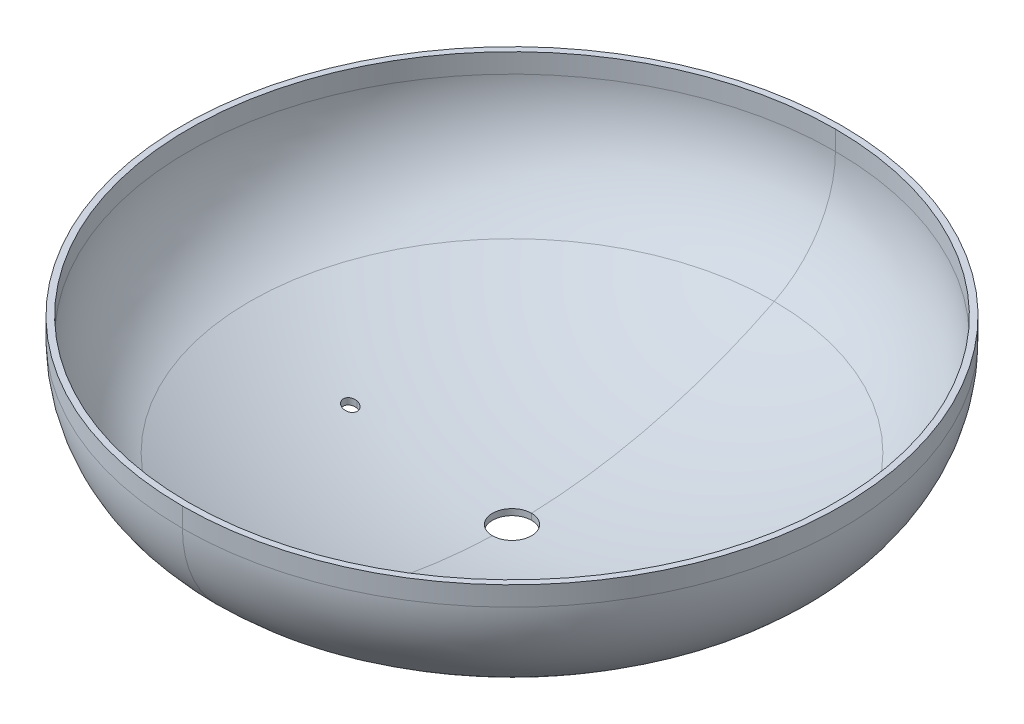
ISO-10303-21;
HEADER;
FILE_DESCRIPTION(('STEP AP214'),'2;1');
FILE_NAME('part.step','',(''),(''),'','','');
FILE_SCHEMA(('AUTOMOTIVE_DESIGN { 1 0 10303 214 1 1 1 1 }'));
ENDSEC;
DATA;
#1=APPLICATION_CONTEXT('core data for automotive mechanical design processes');
#2=APPLICATION_PROTOCOL_DEFINITION('international standard','automotive_design',2000,#1);
#3=PRODUCT_CONTEXT('',#1,'mechanical');
#4=PRODUCT('Part','Part','',(#3));
#5=PRODUCT_RELATED_PRODUCT_CATEGORY('part','',(#4));
#6=PRODUCT_DEFINITION_FORMATION('','',#4);
#7=PRODUCT_DEFINITION_CONTEXT('part definition',#1,'design');
#8=PRODUCT_DEFINITION('design','',#6,#7);
#9=PRODUCT_DEFINITION_SHAPE('','',#8);
#10=(LENGTH_UNIT() NAMED_UNIT(*) SI_UNIT(.MILLI.,.METRE.));
#11=(NAMED_UNIT(*) PLANE_ANGLE_UNIT() SI_UNIT($,.RADIAN.));
#12=(NAMED_UNIT(*) SI_UNIT($,.STERADIAN.) SOLID_ANGLE_UNIT());
#13=UNCERTAINTY_MEASURE_WITH_UNIT(LENGTH_MEASURE(1.E-05),#10,'distance_accuracy_value','');
#14=(GEOMETRIC_REPRESENTATION_CONTEXT(3) GLOBAL_UNCERTAINTY_ASSIGNED_CONTEXT((#13)) GLOBAL_UNIT_ASSIGNED_CONTEXT((#10,
#11,#12)) REPRESENTATION_CONTEXT('',''));
#15=CARTESIAN_POINT('',(0.,0.,0.));
#16=DIRECTION('',(0.,0.,1.));
#17=DIRECTION('',(1.,0.,0.));
#18=AXIS2_PLACEMENT_3D('',#15,#16,#17);
#19=CARTESIAN_POINT('',(-250.,-2270.,0.));
#20=DIRECTION('',(0.,1.,0.));
#21=DIRECTION('',(0.,0.,1.));
#22=AXIS2_PLACEMENT_3D('',#19,#20,#21);
#23=CYLINDRICAL_SURFACE('',#22,10.67);
#24=DIRECTION('',(0.,1.,0.));
#25=VECTOR('',#24,1.);
#26=CARTESIAN_POINT('',(-250.,-2270.,-10.67));
#27=LINE('',#26,#25);
#28=CARTESIAN_POINT('',(-249.999999999986,-254.444220214058,-10.67));
#29=VERTEX_POINT('',#28);
#30=CARTESIAN_POINT('',(-250.000000000004,-244.559103827201,-10.67));
#31=VERTEX_POINT('',#30);
#32=EDGE_CURVE('E134',#29,#31,#27,.T.);
#33=ORIENTED_EDGE('',*,*,#32,.F.);
#34=CARTESIAN_POINT('',(-249.999999999988,-254.444220214053,10.67));
#35=CARTESIAN_POINT('',(-249.690958177809,-254.532520304053,10.6700256628452));
#36=CARTESIAN_POINT('',(-249.381912768903,-254.620807681797,10.6565745288132));
#37=CARTESIAN_POINT('',(-248.765961941325,-254.796744504088,10.6028994040375));
#38=CARTESIAN_POINT('',(-248.45905659263,-254.884393927779,10.5626745419378));
#39=CARTESIAN_POINT('',(-247.849407012571,-255.058478319396,10.4556070030516));
#40=CARTESIAN_POINT('',(-247.546664851496,-255.144912683536,10.3887515456102));
#41=CARTESIAN_POINT('',(-246.947660417101,-255.315906345101,10.2287930645681));
#42=CARTESIAN_POINT('',(-246.651397964982,-255.400465694265,10.1356907662024));
#43=CARTESIAN_POINT('',(-246.067234021696,-255.567174314405,9.92365318958434));
#44=CARTESIAN_POINT('',(-245.779340378261,-255.649321323937,9.80469449794423));
#45=CARTESIAN_POINT('',(-245.214354393786,-255.810511267099,9.54167637984959));
#46=CARTESIAN_POINT('',(-244.937261797163,-255.889554274179,9.39761754777495));
#47=CARTESIAN_POINT('',(-244.396131991928,-256.043896002955,9.08532355936685));
#48=CARTESIAN_POINT('',(-244.132088757792,-256.119196452865,8.91709970406835));
#49=CARTESIAN_POINT('',(-243.619026108752,-256.265494850123,8.55746503980074));
#50=CARTESIAN_POINT('',(-243.370006329501,-256.336492901813,8.36605479348562));
#51=CARTESIAN_POINT('',(-242.893661435372,-256.472288101525,7.96516723805627));
#52=CARTESIAN_POINT('',(-242.666011684157,-256.537178104801,7.75610716319255));
#53=CARTESIAN_POINT('',(-242.229015216438,-256.661728100166,7.31822160018198));
#54=CARTESIAN_POINT('',(-242.01966839499,-256.721388122242,7.08939622538));
#55=CARTESIAN_POINT('',(-241.621066013216,-256.83497192699,6.61352424062765));
#56=CARTESIAN_POINT('',(-241.431811129025,-256.888895516618,6.36647701794838));
#57=CARTESIAN_POINT('',(-241.075087823006,-256.990526783082,5.85592109887569));
#58=CARTESIAN_POINT('',(-240.90761868908,-257.038234663087,5.59241294094894));
#59=CARTESIAN_POINT('',(-240.601900905172,-257.125320031995,5.06112512600973));
#60=CARTESIAN_POINT('',(-240.462786919802,-257.164944267769,4.79388357078607));
#61=CARTESIAN_POINT('',(-240.207378164364,-257.237688909428,4.24785752963024));
#62=CARTESIAN_POINT('',(-240.091082851051,-257.270809470146,3.96907331868633));
#63=CARTESIAN_POINT('',(-239.882388892199,-257.330242185474,3.40207082500413));
#64=CARTESIAN_POINT('',(-239.789984465266,-257.356555987263,3.11385484372926));
#65=CARTESIAN_POINT('',(-239.629892996476,-257.402143357173,2.53009380155223));
#66=CARTESIAN_POINT('',(-239.562205404403,-257.421417082011,2.23454890395326));
#67=CARTESIAN_POINT('',(-239.454060662112,-257.452210147544,1.64857052590822));
#68=CARTESIAN_POINT('',(-239.41275389035,-257.463971435926,1.3583062565748));
#69=CARTESIAN_POINT('',(-239.3541617141,-257.480654260206,0.775171432952617));
#70=CARTESIAN_POINT('',(-239.336875705071,-257.485575968238,0.482300944442359));
#71=CARTESIAN_POINT('',(-239.326479828441,-257.488535913546,-0.103879339706276));
#72=CARTESIAN_POINT('',(-239.333368033707,-257.486574699518,-0.397189098463404));
#73=CARTESIAN_POINT('',(-239.371254373268,-257.475787513716,-0.982119848255914));
#74=CARTESIAN_POINT('',(-239.40225242233,-257.46696156621,-1.2737408452578));
#75=CARTESIAN_POINT('',(-239.487438933208,-257.442706104497,-1.84883628405242));
#76=CARTESIAN_POINT('',(-239.541274398317,-257.427377107378,-2.13236735354715));
#77=CARTESIAN_POINT('',(-239.671606290424,-257.390265280654,-2.69373570580715));
#78=CARTESIAN_POINT('',(-239.748102401894,-257.36848254091,-2.97157306779422));
#79=CARTESIAN_POINT('',(-239.923107974553,-257.31864620689,-3.51964503373748));
#80=CARTESIAN_POINT('',(-240.021617486223,-257.290592598233,-3.78987962025767));
#81=CARTESIAN_POINT('',(-240.239832426797,-257.228445529315,-4.32093047885156));
#82=CARTESIAN_POINT('',(-240.359538112939,-257.194351995753,-4.58174663657624));
#83=CARTESIAN_POINT('',(-240.620487922352,-257.120025415921,-5.09483327322721));
#84=CARTESIAN_POINT('',(-240.761937458326,-257.079733814031,-5.3469907730421));
#85=CARTESIAN_POINT('',(-241.064335475441,-256.993589547384,-5.83832301433569));
#86=CARTESIAN_POINT('',(-241.225284017077,-256.947736865375,-6.07749771553267));
#87=CARTESIAN_POINT('',(-241.565429255189,-256.850824222466,-6.54137903018745));
#88=CARTESIAN_POINT('',(-241.744626297614,-256.799764162847,-6.76608536922769));
#89=CARTESIAN_POINT('',(-242.119921982498,-256.692817800493,-7.19968699737551));
#90=CARTESIAN_POINT('',(-242.316021451074,-256.63693126186,-7.40858151273216));
#91=CARTESIAN_POINT('',(-242.729791405268,-256.518998344867,-7.81534570076372));
#92=CARTESIAN_POINT('',(-242.947931682881,-256.456817712219,-8.0126986578873));
#93=CARTESIAN_POINT('',(-243.398997150968,-256.328227255644,-8.38819301702744));
#94=CARTESIAN_POINT('',(-243.63192269449,-256.261817330728,-8.56633396002052));
#95=CARTESIAN_POINT('',(-244.110936984529,-256.125227914581,-8.90244135928185));
#96=CARTESIAN_POINT('',(-244.357028795808,-256.055047545672,-9.06040308911507));
#97=CARTESIAN_POINT('',(-244.860719386519,-255.911387003788,-9.35531426753091));
#98=CARTESIAN_POINT('',(-245.118323095946,-255.837905416985,-9.49225460013045));
#99=CARTESIAN_POINT('',(-245.653238037862,-255.685300528036,-9.74914970213504));
#100=CARTESIAN_POINT('',(-245.930926192093,-255.606068939638,-9.86825579670044));
#101=CARTESIAN_POINT('',(-246.494655152362,-255.445199800875,-10.0822775807347));
#102=CARTESIAN_POINT('',(-246.780692572881,-255.363563225581,-10.177202927386));
#103=CARTESIAN_POINT('',(-247.358999916362,-255.198487428843,-10.3423583723902));
#104=CARTESIAN_POINT('',(-247.651264157104,-255.115049850045,-10.4126100420462));
#105=CARTESIAN_POINT('',(-248.240198609792,-254.946892173077,-10.5281521656585));
#106=CARTESIAN_POINT('',(-248.536866765447,-254.86217267313,-10.5734539148218));
#107=CARTESIAN_POINT('',(-249.028431402597,-254.721775835494,-10.6274612256523));
#108=CARTESIAN_POINT('',(-249.222620045336,-254.66630790065,-10.6434253453223));
#109=CARTESIAN_POINT('',(-249.611200393174,-254.555303367864,-10.6646863806885));
#110=CARTESIAN_POINT('',(-249.805591181876,-254.499767049927,-10.6700015069371));
#111=CARTESIAN_POINT('',(-249.999999999972,-254.444220214058,-10.67));
#112=B_SPLINE_CURVE_WITH_KNOTS('',3,(#34,#35,#36,#37,#38,#39,#40,#41,#42,#43,#44,#45,#46,#47,
#48,#49,#50,#51,#52,#53,#54,#55,#56,#57,#58,#59,#60,#61,#62,#63,#64,#65,#66,#67,#68,#69,#70,#71,
#72,#73,#74,#75,#76,#77,#78,#79,#80,#81,#82,#83,#84,#85,#86,#87,#88,#89,#90,#91,#92,#93,#94,#95,
#96,#97,#98,#99,#100,#101,#102,#103,#104,#105,#106,#107,#108,#109,#110,#111),.UNSPECIFIED.,.F.,
.F.,(4,2,2,2,2,2,2,2,2,2,2,2,2,2,2,2,2,2,2,2,2,2,2,2,2,2,2,2,2,2,2,2,2,2,2,2,2,2,4),(0.,
0.963946509016767,1.92792439138541,2.8923654681017,3.85677989864368,4.82207128770501,
5.7873398214427,6.75215839771369,7.71695356584339,8.66323282179292,9.60950665162768,
10.5558123154397,11.5020870400912,12.4125875688761,13.3230664186776,14.2333247336124,
15.1435627843305,16.0227709232127,16.9019569342976,17.7810728595457,18.6601856769241,
19.5261786538619,20.3921595732505,21.2581424784936,22.1241358940913,22.9988797232503,
23.873626266322,24.7483893955934,25.6231953037251,26.5241697725205,27.4251657631028,
28.3263724022078,29.227968754537,30.164006005888,31.0996688393323,32.0345116083797,
32.9689308113292,33.5764262060771,34.1828818498248),.UNSPECIFIED.);
#113=CARTESIAN_POINT('',(-249.999999999994,-254.444220214053,10.67));
#114=VERTEX_POINT('',#113);
#115=EDGE_CURVE('E124',#114,#29,#112,.T.);
#116=ORIENTED_EDGE('',*,*,#115,.F.);
#117=DIRECTION('',(0.,1.,0.));
#118=VECTOR('',#117,1.);
#119=CARTESIAN_POINT('',(-250.,-2270.,10.67));
#120=LINE('',#119,#118);
#121=CARTESIAN_POINT('',(-250.,-244.559103827202,10.67));
#122=VERTEX_POINT('',#121);
#123=EDGE_CURVE('E131',#114,#122,#120,.T.);
#124=ORIENTED_EDGE('',*,*,#123,.T.);
#125=CARTESIAN_POINT('',(-250.000000000004,-244.559103827201,-10.67));
#126=CARTESIAN_POINT('',(-249.690751947948,-244.648473115967,-10.6700255050531));
#127=CARTESIAN_POINT('',(-249.381500034014,-244.737829290581,-10.6565565942548));
#128=CARTESIAN_POINT('',(-248.765135968705,-244.915895830537,-10.60280938603));
#129=CARTESIAN_POINT('',(-248.458023891264,-245.00460617357,-10.5625301668675));
#130=CARTESIAN_POINT('',(-247.847953491427,-245.180800019885,-10.455314560076));
#131=CARTESIAN_POINT('',(-247.5449973604,-245.268282876448,-10.3883646290361));
#132=CARTESIAN_POINT('',(-246.945568490978,-245.441350492351,-10.2281757054309));
#133=CARTESIAN_POINT('',(-246.649095571389,-245.52693530474,-10.1349374485996));
#134=CARTESIAN_POINT('',(-246.06451720539,-245.695664895567,-9.92258386673313));
#135=CARTESIAN_POINT('',(-245.776419598044,-245.778807388777,-9.80344513095036));
#136=CARTESIAN_POINT('',(-245.211029403259,-245.941951294792,-9.54001692980593));
#137=CARTESIAN_POINT('',(-244.933736809296,-246.021952709494,-9.39572747963068));
#138=CARTESIAN_POINT('',(-244.392228365548,-246.178161933608,-9.08292454323204));
#139=CARTESIAN_POINT('',(-244.128006247311,-246.254371561622,-8.91442282335621));
#140=CARTESIAN_POINT('',(-243.614608688838,-246.402432284591,-8.55418076699356));
#141=CARTESIAN_POINT('',(-243.365432875768,-246.474283487543,-8.36244100668034));
#142=CARTESIAN_POINT('',(-242.88891532182,-246.61167383566,-7.96093776747883));
#143=CARTESIAN_POINT('',(-242.661240993245,-246.677309200032,-7.75160198176137));
#144=CARTESIAN_POINT('',(-242.224229509563,-246.803280276411,-7.31314488234404));
#145=CARTESIAN_POINT('',(-242.014891199472,-246.863616322221,-7.08402481666103));
#146=CARTESIAN_POINT('',(-241.616327528874,-246.978480448494,-6.60752731162634));
#147=CARTESIAN_POINT('',(-241.427103352783,-247.033008186936,-6.36014879858095));
#148=CARTESIAN_POINT('',(-241.070477215604,-247.135766599853,-5.84890169851032));
#149=CARTESIAN_POINT('',(-240.903074522802,-247.183997485473,-5.58503366484751));
#150=CARTESIAN_POINT('',(-240.597662186069,-247.271984350941,-5.05324642318098));
#151=CARTESIAN_POINT('',(-240.458766507624,-247.311995855714,-4.78587805881876));
#152=CARTESIAN_POINT('',(-240.203800137648,-247.385439405337,-4.23960094519234));
#153=CARTESIAN_POINT('',(-240.08772889003,-247.418871610481,-3.96069247728753));
#154=CARTESIAN_POINT('',(-239.879492407973,-247.478847544336,-3.39344768200502));
#155=CARTESIAN_POINT('',(-239.787321288969,-247.505392968675,-3.10511369505487));
#156=CARTESIAN_POINT('',(-239.627707677362,-247.551360373863,-2.52112550563063));
#157=CARTESIAN_POINT('',(-239.560264621135,-247.570782517074,-2.2254714701659));
#158=CARTESIAN_POINT('',(-239.452653204536,-247.601771622161,-1.63951142486662));
#159=CARTESIAN_POINT('',(-239.411616793822,-247.613588586704,-1.34937773534275));
#160=CARTESIAN_POINT('',(-239.353540159285,-247.630312360262,-0.766524146628102));
#161=CARTESIAN_POINT('',(-239.336499317856,-247.635219347128,-0.473804314195474));
#162=CARTESIAN_POINT('',(-239.326567054245,-247.6380793972,0.112053904480323));
#163=CARTESIAN_POINT('',(-239.333673659383,-247.636033028446,0.405192254577899));
#164=CARTESIAN_POINT('',(-239.371967745469,-247.625005956381,0.989760081973713));
#165=CARTESIAN_POINT('',(-239.403155140547,-247.616025277796,1.28118956536181));
#166=CARTESIAN_POINT('',(-239.488673979088,-247.59139871033,1.85580609252757));
#167=CARTESIAN_POINT('',(-239.542646482648,-247.575856191653,2.13905109093087));
#168=CARTESIAN_POINT('',(-239.673205761862,-247.538257448558,2.69983329268302));
#169=CARTESIAN_POINT('',(-239.749792216555,-247.516201316589,2.97737057698194));
#170=CARTESIAN_POINT('',(-239.92492900775,-247.465761171515,3.52483233361506));
#171=CARTESIAN_POINT('',(-240.023479403823,-247.437377141248,3.7947567852994));
#172=CARTESIAN_POINT('',(-240.241724050348,-247.374515536367,4.32518196414856));
#173=CARTESIAN_POINT('',(-240.361418563269,-247.340037886111,4.58568257428394));
#174=CARTESIAN_POINT('',(-240.622326899165,-247.26487871754,5.09820467056097));
#175=CARTESIAN_POINT('',(-240.763751143568,-247.224136533015,5.3501101142857));
#176=CARTESIAN_POINT('',(-241.066052087395,-247.137041147765,5.84093761925979));
#177=CARTESIAN_POINT('',(-241.226928849323,-247.090687929012,6.07985963878763));
#178=CARTESIAN_POINT('',(-241.566882834031,-246.992728576825,6.54324154963609));
#179=CARTESIAN_POINT('',(-241.745960430111,-246.941122335651,6.76770114417624));
#180=CARTESIAN_POINT('',(-242.120968992907,-246.833042409856,7.20082181849803));
#181=CARTESIAN_POINT('',(-242.316900794804,-246.776568484025,7.4094821144074));
#182=CARTESIAN_POINT('',(-242.730419793642,-246.657366141709,7.81592607445223));
#183=CARTESIAN_POINT('',(-242.948486073564,-246.594499249414,8.01318180010022));
#184=CARTESIAN_POINT('',(-243.399373763318,-246.464496406682,8.3884848520076));
#185=CARTESIAN_POINT('',(-243.632195531039,-246.397360352698,8.56653171207872));
#186=CARTESIAN_POINT('',(-244.110973526401,-246.259283688309,8.90246068159112));
#187=CARTESIAN_POINT('',(-244.356932846876,-246.18834218201,9.06033801279982));
#188=CARTESIAN_POINT('',(-244.860330795348,-246.043129361863,9.35509564102253));
#189=CARTESIAN_POINT('',(-245.117774340791,-245.968856621533,9.49196682981275));
#190=CARTESIAN_POINT('',(-245.652551916131,-245.814551907164,9.74884529420986));
#191=CARTESIAN_POINT('',(-245.930270100317,-245.734408292386,9.86798627419003));
#192=CARTESIAN_POINT('',(-246.494049475063,-245.571689925506,10.0820680143956));
#193=CARTESIAN_POINT('',(-246.780107293652,-245.489116155865,10.1770184084419));
#194=CARTESIAN_POINT('',(-247.358447875669,-245.322147035507,10.3422180430552));
#195=CARTESIAN_POINT('',(-247.650724986863,-245.237753337917,10.4124887748003));
#196=CARTESIAN_POINT('',(-248.239678979767,-245.067670004229,10.5280656705288));
#197=CARTESIAN_POINT('',(-248.536353811234,-244.981980971676,10.5733831139372));
#198=CARTESIAN_POINT('',(-249.028008714168,-244.839954068789,10.6274241629017));
#199=CARTESIAN_POINT('',(-249.222282320376,-244.783827759396,10.6434022368648));
#200=CARTESIAN_POINT('',(-249.611031920102,-244.671505632271,10.6646817792289));
#201=CARTESIAN_POINT('',(-249.805506997332,-244.61531009816,10.67000148398));
#202=CARTESIAN_POINT('',(-250.,-244.559103827202,10.67));
#203=B_SPLINE_CURVE_WITH_KNOTS('',3,(#125,#126,#127,#128,#129,#130,#131,#132,#133,#134,#135,
#136,#137,#138,#139,#140,#141,#142,#143,#144,#145,#146,#147,#148,#149,#150,#151,#152,#153,#154,
#155,#156,#157,#158,#159,#160,#161,#162,#163,#164,#165,#166,#167,#168,#169,#170,#171,#172,#173,
#174,#175,#176,#177,#178,#179,#180,#181,#182,#183,#184,#185,#186,#187,#188,#189,#190,#191,#192,
#193,#194,#195,#196,#197,#198,#199,#200,#201,#202),.UNSPECIFIED.,.F.,.F.,(4,2,2,2,2,2,2,2,2,2,2,
2,2,2,2,2,2,2,2,2,2,2,2,2,2,2,2,2,2,2,2,2,2,2,2,2,2,2,4),(0.,0.965426875302441,1.93088694360528,
2.89683789959709,3.86276182410609,4.82956247844039,5.79636254900693,6.76269436638218,
7.72900222902571,8.67634134842857,9.62362075210398,10.5709559052922,11.5182592844541,
12.4289457556888,13.3396100365358,14.2500498849933,15.1604689805669,16.0391826226025,
16.9178736475989,17.7964928913098,18.6751090019936,19.5403721597755,20.4056230374238,
21.2708762618431,22.136140227674,23.0103832424996,23.884629066491,24.7588928249927,
25.6331999311582,26.5342509396041,27.4353238111294,28.3366097557057,29.2382853987504,
30.1751402052676,31.1116213271726,32.0472849225964,32.9825252299466,33.5908116466152,
34.1980564002098),.UNSPECIFIED.);
#204=EDGE_CURVE('E167',#31,#122,#203,.T.);
#205=ORIENTED_EDGE('',*,*,#204,.F.);
#206=EDGE_LOOP('',(#33,#116,#124,#205));
#207=FACE_BOUND('',#206,.T.);
#208=ADVANCED_FACE('F17',(#207),#23,.F.);
#209=CARTESIAN_POINT('',(0.,-2270.,0.));
#210=DIRECTION('',(0.,1.,0.));
#211=DIRECTION('',(0.,0.,1.));
#212=AXIS2_PLACEMENT_3D('',#209,#210,#211);
#213=CYLINDRICAL_SURFACE('',#212,30.16);
#214=DIRECTION('',(0.,1.,0.));
#215=VECTOR('',#214,1.);
#216=CARTESIAN_POINT('',(0.,-2270.,-30.16));
#217=LINE('',#216,#215);
#218=CARTESIAN_POINT('',(0.,-289.004851663673,-30.16));
#219=VERTEX_POINT('',#218);
#220=CARTESIAN_POINT('',(0.,-279.499622069205,-30.16));
#221=VERTEX_POINT('',#220);
#222=EDGE_CURVE('E234',#219,#221,#217,.T.);
#223=ORIENTED_EDGE('',*,*,#222,.F.);
#224=CARTESIAN_POINT('',(0.,-289.004851663673,0.));
#225=DIRECTION('',(0.,1.,0.));
#226=DIRECTION('',(0.,0.,1.));
#227=AXIS2_PLACEMENT_3D('',#224,#225,#226);
#228=CIRCLE('',#227,30.16);
#229=CARTESIAN_POINT('',(0.,-289.004851663673,30.16));
#230=VERTEX_POINT('',#229);
#231=EDGE_CURVE('E238',#230,#219,#228,.T.);
#232=ORIENTED_EDGE('',*,*,#231,.F.);
#233=DIRECTION('',(0.,1.,0.));
#234=VECTOR('',#233,1.);
#235=CARTESIAN_POINT('',(0.,-2270.,30.16));
#236=LINE('',#235,#234);
#237=CARTESIAN_POINT('',(0.,-279.499622069205,30.16));
#238=VERTEX_POINT('',#237);
#239=EDGE_CURVE('E248',#230,#238,#236,.T.);
#240=ORIENTED_EDGE('',*,*,#239,.T.);
#241=CARTESIAN_POINT('',(0.,-279.499622069205,0.));
#242=DIRECTION('',(0.,-1.,0.));
#243=DIRECTION('',(0.,0.,1.));
#244=AXIS2_PLACEMENT_3D('',#241,#242,#243);
#245=CIRCLE('',#244,30.16);
#246=EDGE_CURVE('E240',#221,#238,#245,.T.);
#247=ORIENTED_EDGE('',*,*,#246,.F.);
#248=EDGE_LOOP('',(#223,#232,#240,#247));
#249=FACE_BOUND('',#248,.T.);
#250=ADVANCED_FACE('F201',(#249),#213,.F.);
#251=CARTESIAN_POINT('',(-500.,0.,0.));
#252=DIRECTION('',(0.,-1.,0.));
#253=DIRECTION('',(0.,0.,-1.));
#254=AXIS2_PLACEMENT_3D('',#251,#252,#253);
#255=PLANE('',#254);
#256=CARTESIAN_POINT('',(0.,0.,0.));
#257=DIRECTION('',(0.,-1.,0.));
#258=DIRECTION('',(0.,0.,-1.));
#259=AXIS2_PLACEMENT_3D('',#256,#257,#258);
#260=CIRCLE('',#259,500.);
#261=CARTESIAN_POINT('',(0.,0.,-500.));
#262=VERTEX_POINT('',#261);
#263=CARTESIAN_POINT('',(0.,0.,500.));
#264=VERTEX_POINT('',#263);
#265=EDGE_CURVE('E49',#262,#264,#260,.T.);
#266=ORIENTED_EDGE('',*,*,#265,.T.);
#267=CARTESIAN_POINT('',(0.,0.,0.));
#268=DIRECTION('',(0.,-1.,0.));
#269=DIRECTION('',(0.,0.,-1.));
#270=AXIS2_PLACEMENT_3D('',#267,#268,#269);
#271=CIRCLE('',#270,500.);
#272=EDGE_CURVE('E294',#264,#262,#271,.T.);
#273=ORIENTED_EDGE('',*,*,#272,.T.);
#274=EDGE_LOOP('',(#266,#273));
#275=FACE_BOUND('',#274,.T.);
#276=CARTESIAN_POINT('',(0.,0.,0.));
#277=DIRECTION('',(0.,-1.,0.));
#278=DIRECTION('',(0.,0.,-1.));
#279=AXIS2_PLACEMENT_3D('',#276,#277,#278);
#280=CIRCLE('',#279,509.5);
#281=CARTESIAN_POINT('',(0.,0.,-509.5));
#282=VERTEX_POINT('',#281);
#283=CARTESIAN_POINT('',(0.,0.,509.5));
#284=VERTEX_POINT('',#283);
#285=EDGE_CURVE('E271',#282,#284,#280,.T.);
#286=ORIENTED_EDGE('',*,*,#285,.F.);
#287=CARTESIAN_POINT('',(0.,0.,0.));
#288=DIRECTION('',(0.,-1.,0.));
#289=DIRECTION('',(0.,0.,-1.));
#290=AXIS2_PLACEMENT_3D('',#287,#288,#289);
#291=CIRCLE('',#290,509.5);
#292=EDGE_CURVE('E11',#284,#282,#291,.T.);
#293=ORIENTED_EDGE('',*,*,#292,.F.);
#294=EDGE_LOOP('',(#286,#293));
#295=FACE_BOUND('',#294,.T.);
#296=ADVANCED_FACE('F198',(#275,#295),#255,.F.);
#297=CARTESIAN_POINT('',(0.,0.,0.));
#298=DIRECTION('',(0.,-1.,0.));
#299=DIRECTION('',(0.,0.,-1.));
#300=AXIS2_PLACEMENT_3D('',#297,#298,#299);
#301=CYLINDRICAL_SURFACE('',#300,509.5);
#302=DIRECTION('',(0.,-1.,0.));
#303=VECTOR('',#302,1.);
#304=CARTESIAN_POINT('',(0.,0.,509.5));
#305=LINE('',#304,#303);
#306=CARTESIAN_POINT('',(0.,-30.,509.5));
#307=VERTEX_POINT('',#306);
#308=EDGE_CURVE('E268',#284,#307,#305,.T.);
#309=ORIENTED_EDGE('',*,*,#308,.F.);
#310=ORIENTED_EDGE('',*,*,#292,.T.);
#311=DIRECTION('',(0.,-1.,0.));
#312=VECTOR('',#311,1.);
#313=CARTESIAN_POINT('',(0.,0.,-509.5));
#314=LINE('',#313,#312);
#315=CARTESIAN_POINT('',(0.,-30.,-509.5));
#316=VERTEX_POINT('',#315);
#317=EDGE_CURVE('E267',#282,#316,#314,.T.);
#318=ORIENTED_EDGE('',*,*,#317,.T.);
#319=CARTESIAN_POINT('',(0.,-30.,0.));
#320=DIRECTION('',(0.,-1.,0.));
#321=DIRECTION('',(0.,0.,-1.));
#322=AXIS2_PLACEMENT_3D('',#319,#320,#321);
#323=CIRCLE('',#322,509.5);
#324=EDGE_CURVE('E34',#307,#316,#323,.T.);
#325=ORIENTED_EDGE('',*,*,#324,.F.);
#326=EDGE_LOOP('',(#309,#310,#318,#325));
#327=FACE_BOUND('',#326,.T.);
#328=ADVANCED_FACE('F200',(#327),#301,.T.);
#329=CARTESIAN_POINT('',(0.,-30.,0.));
#330=DIRECTION('',(0.,-1.,0.));
#331=DIRECTION('',(0.,0.,-1.));
#332=AXIS2_PLACEMENT_3D('',#329,#330,#331);
#333=TOROIDAL_SURFACE('',#332,328.,181.5);
#334=CARTESIAN_POINT('',(0.,-30.,328.));
#335=DIRECTION('',(1.,0.,0.));
#336=DIRECTION('',(0.,0.,-1.));
#337=AXIS2_PLACEMENT_3D('',#334,#335,#336);
#338=CIRCLE('',#337,181.5);
#339=CARTESIAN_POINT('',(0.,-192.05356820957,409.736717762253));
#340=VERTEX_POINT('',#339);
#341=EDGE_CURVE('E275',#307,#340,#338,.T.);
#342=ORIENTED_EDGE('',*,*,#341,.F.);
#343=ORIENTED_EDGE('',*,*,#324,.T.);
#344=CARTESIAN_POINT('',(0.,-30.,-328.));
#345=DIRECTION('',(-1.,0.,0.));
#346=DIRECTION('',(0.,0.,1.));
#347=AXIS2_PLACEMENT_3D('',#344,#345,#346);
#348=CIRCLE('',#347,181.5);
#349=CARTESIAN_POINT('',(0.,-192.05356820957,-409.736717762253));
#350=VERTEX_POINT('',#349);
#351=EDGE_CURVE('E279',#316,#350,#348,.T.);
#352=ORIENTED_EDGE('',*,*,#351,.T.);
#353=CARTESIAN_POINT('',(0.,-192.05356820957,0.));
#354=DIRECTION('',(0.,-1.,0.));
#355=DIRECTION('',(0.,0.,-1.));
#356=AXIS2_PLACEMENT_3D('',#353,#354,#355);
#357=CIRCLE('',#356,409.736717762253);
#358=EDGE_CURVE('E137',#340,#350,#357,.T.);
#359=ORIENTED_EDGE('',*,*,#358,.F.);
#360=EDGE_LOOP('',(#342,#343,#352,#359));
#361=FACE_BOUND('',#360,.T.);
#362=ADVANCED_FACE('F19',(#361),#333,.T.);
#363=CARTESIAN_POINT('',(0.,619.999987088524,0.));
#364=DIRECTION('',(0.,-1.,0.));
#365=DIRECTION('',(0.,0.,-1.));
#366=AXIS2_PLACEMENT_3D('',#363,#364,#365);
#367=DEGENERATE_TOROIDAL_SURFACE('',#366,0.152448865454291,909.5,.T.);
#368=ORIENTED_EDGE('',*,*,#115,.T.);
#369=CARTESIAN_POINT('',(-249.999999999971,-254.444220214057,-10.67));
#370=CARTESIAN_POINT('',(-250.309147078977,-254.355890317838,-10.6700256348866));
#371=CARTESIAN_POINT('',(-250.618290171769,-254.267547813224,-10.6565653888479));
#372=CARTESIAN_POINT('',(-251.234419976688,-254.091452379317,-10.6028575830251));
#373=CARTESIAN_POINT('',(-251.541406623055,-254.003699468007,-10.5626092099008));
#374=CARTESIAN_POINT('',(-252.151200281873,-253.829362228375,-10.4554842883941));
#375=CARTESIAN_POINT('',(-252.454005248552,-253.742778472461,-10.3885951531525));
#376=CARTESIAN_POINT('',(-253.053120183334,-253.571442974787,-10.2285620097094));
#377=CARTESIAN_POINT('',(-253.349430326364,-253.486691183686,-10.1354187095542));
#378=CARTESIAN_POINT('',(-253.933669231329,-253.319561027047,-9.92329662594874));
#379=CARTESIAN_POINT('',(-254.221590334146,-253.237184831065,-9.80429502361272));
#380=CARTESIAN_POINT('',(-254.786627023247,-253.075501736157,-9.54118558664837));
#381=CARTESIAN_POINT('',(-255.063742609094,-252.996194837354,-9.39707775100358));
#382=CARTESIAN_POINT('',(-255.604907510348,-252.841300116636,-9.08468365470381));
#383=CARTESIAN_POINT('',(-255.868962941211,-252.765710554165,-8.9164088571921));
#384=CARTESIAN_POINT('',(-256.382043289673,-252.618815949282,-8.55666890063639));
#385=CARTESIAN_POINT('',(-256.631068568888,-252.54751080379,-8.36520429985771));
#386=CARTESIAN_POINT('',(-257.107471123485,-252.411083406754,-7.9641607410264));
#387=CARTESIAN_POINT('',(-257.335169521724,-252.345869504356,-7.75499446833994));
#388=CARTESIAN_POINT('',(-257.772238180138,-252.220677929601,-7.31689434928166));
#389=CARTESIAN_POINT('',(-257.981609581057,-252.160699931341,-7.08796173500683));
#390=CARTESIAN_POINT('',(-258.380254544525,-252.046490547508,-6.61185586731303));
#391=CARTESIAN_POINT('',(-258.569526909397,-251.99225950439,-6.36468152837684));
#392=CARTESIAN_POINT('',(-258.926270183489,-251.89003553313,-5.85385701291987));
#393=CARTESIAN_POINT('',(-259.093741813066,-251.842042398871,-5.5902073812153));
#394=CARTESIAN_POINT('',(-259.399411096523,-251.754439023529,-5.05869097762173));
#395=CARTESIAN_POINT('',(-259.538479923377,-251.714579365469,-4.79136603400634));
#396=CARTESIAN_POINT('',(-259.793790173238,-251.641398562566,-4.24516720124924));
#397=CARTESIAN_POINT('',(-259.91003214203,-251.608077261392,-3.96629358842684));
#398=CARTESIAN_POINT('',(-260.118608696034,-251.548285070396,-3.3991083819667));
#399=CARTESIAN_POINT('',(-260.21094912635,-251.521812505722,-3.11079911527462));
#400=CARTESIAN_POINT('',(-260.370900141104,-251.475955494048,-2.52684939559252));
#401=CARTESIAN_POINT('',(-260.438511287404,-251.456570886007,-2.23120910932997));
#402=CARTESIAN_POINT('',(-260.546464619434,-251.425619226501,-1.64519330472706));
#403=CARTESIAN_POINT('',(-260.587669110835,-251.413804968307,-1.35498937998742));
#404=CARTESIAN_POINT('',(-260.646068043849,-251.397060531883,-0.771981810710305));
#405=CARTESIAN_POINT('',(-260.663263098449,-251.3921301779,-0.479178232736824));
#406=CARTESIAN_POINT('',(-260.673488751429,-251.389198176998,0.106860496091341));
#407=CARTESIAN_POINT('',(-260.666521317851,-251.391195965779,0.400095609852686));
#408=CARTESIAN_POINT('',(-260.628489189032,-251.402100840295,0.984869195389632));
#409=CARTESIAN_POINT('',(-260.597424580864,-251.411007901064,1.27640767329201));
#410=CARTESIAN_POINT('',(-260.512131251332,-251.435463128971,1.85125474879148));
#411=CARTESIAN_POINT('',(-260.458261501563,-251.450908379442,2.13462109135222));
#412=CARTESIAN_POINT('',(-260.327888330145,-251.488286862726,2.69565583381539));
#413=CARTESIAN_POINT('',(-260.251385228908,-251.510220003692,2.97332431432081));
#414=CARTESIAN_POINT('',(-260.076394050804,-251.560386831495,3.52105706928064));
#415=CARTESIAN_POINT('',(-259.977905909629,-251.588620536761,3.79112132148945));
#416=CARTESIAN_POINT('',(-259.759762910043,-251.651152108081,4.32183310738695));
#417=CARTESIAN_POINT('',(-259.64010778975,-251.685450049163,4.5824805245203));
#418=CARTESIAN_POINT('',(-259.379261644821,-251.760213777534,5.09528755623862));
#419=CARTESIAN_POINT('',(-259.237861173763,-251.800739546842,5.3473318611654));
#420=CARTESIAN_POINT('',(-258.935582848865,-251.887366422145,5.83844179810577));
#421=CARTESIAN_POINT('',(-258.774704932685,-251.933467545984,6.07750738857639));
#422=CARTESIAN_POINT('',(-258.434721573827,-252.030884387563,6.5411787283698));
#423=CARTESIAN_POINT('',(-258.255615757006,-252.082200212339,6.76578418073297));
#424=CARTESIAN_POINT('',(-257.880521724544,-252.189658386078,7.19919584707834));
#425=CARTESIAN_POINT('',(-257.684532677024,-252.245800972867,7.40800128160174));
#426=CARTESIAN_POINT('',(-257.270904893512,-252.364275415295,7.81469763526764));
#427=CARTESIAN_POINT('',(-257.052789144248,-252.426743536546,8.01206381266523));
#428=CARTESIAN_POINT('',(-256.601773561701,-252.555898978015,8.38758610157327));
#429=CARTESIAN_POINT('',(-256.368873370825,-252.622586400284,8.56574174815499));
#430=CARTESIAN_POINT('',(-255.889907961118,-252.759714094823,8.90188202441966));
#431=CARTESIAN_POINT('',(-255.643839644048,-252.830155250266,9.05986187720579));
#432=CARTESIAN_POINT('',(-255.140192243953,-252.97431428462,9.35481314730069));
#433=CARTESIAN_POINT('',(-254.882608228474,-253.048033567558,9.49177544876884));
#434=CARTESIAN_POINT('',(-254.347637061395,-253.201119391242,9.7487624213173));
#435=CARTESIAN_POINT('',(-254.069869294677,-253.280594079677,9.86793084490106));
#436=CARTESIAN_POINT('',(-253.505966153164,-253.441914685498,10.0820645756714));
#437=CARTESIAN_POINT('',(-253.219834169437,-253.523759641795,10.1770395438599));
#438=CARTESIAN_POINT('',(-252.641323048519,-253.689212484788,10.3422790637993));
#439=CARTESIAN_POINT('',(-252.348949626745,-253.772818757758,10.4125652738656));
#440=CARTESIAN_POINT('',(-251.759781472222,-253.941270825316,10.528158896802));
#441=CARTESIAN_POINT('',(-251.4629888057,-254.026116040297,10.5734776285977));
#442=CARTESIAN_POINT('',(-250.971343799364,-254.166643590378,10.627480818863));
#443=CARTESIAN_POINT('',(-250.777204163905,-254.222129476733,10.643437333322));
#444=CARTESIAN_POINT('',(-250.388716046653,-254.333150271938,10.6646885852149));
#445=CARTESIAN_POINT('',(-250.194368488744,-254.388684934966,10.6700014963711));
#446=CARTESIAN_POINT('',(-249.999999999988,-254.444220214053,10.67));
#447=B_SPLINE_CURVE_WITH_KNOTS('',3,(#369,#370,#371,#372,#373,#374,#375,#376,#377,#378,#379,
#380,#381,#382,#383,#384,#385,#386,#387,#388,#389,#390,#391,#392,#393,#394,#395,#396,#397,#398,
#399,#400,#401,#402,#403,#404,#405,#406,#407,#408,#409,#410,#411,#412,#413,#414,#415,#416,#417,
#418,#419,#420,#421,#422,#423,#424,#425,#426,#427,#428,#429,#430,#431,#432,#433,#434,#435,#436,
#437,#438,#439,#440,#441,#442,#443,#444,#445,#446),.UNSPECIFIED.,.F.,.F.,(4,2,2,2,2,2,2,2,2,2,2,
2,2,2,2,2,2,2,2,2,2,2,2,2,2,2,2,2,2,2,2,2,2,2,2,2,2,2,4),(0.,0.964273935829866,1.92857715024327,
2.89333650680381,3.85806984733958,4.82365800793224,5.78924620761762,6.75437790221804,
7.71948636710437,8.66628081561359,9.61301629005437,10.5598081477392,11.5065687128179,
12.4173185514728,13.3280466116428,14.2385517430974,15.1490361861283,16.028028306087,
16.9069979840359,17.7858960712984,18.6647909827737,19.5303376319402,20.3958720284766,
21.2614089568075,22.1269565945131,23.0014339349343,23.8759140742648,24.7504121665708,
25.6249533722106,26.5260795506234,27.4272275329864,28.3285884805413,29.2303392727235,
30.1668447469426,31.1029756647209,32.0382832946764,32.9731665562967,33.5805342290483,
34.1868639477205),.UNSPECIFIED.);
#448=EDGE_CURVE('E21',#29,#114,#447,.T.);
#449=ORIENTED_EDGE('',*,*,#448,.T.);
#450=EDGE_LOOP('',(#368,#449));
#451=FACE_BOUND('',#450,.T.);
#452=CARTESIAN_POINT('',(0.,619.999987088524,0.152448865454291));
#453=DIRECTION('',(1.,0.,0.));
#454=DIRECTION('',(0.,0.,-1.));
#455=AXIS2_PLACEMENT_3D('',#452,#453,#454);
#456=CIRCLE('',#455,909.5);
#457=EDGE_CURVE('E276',#340,#230,#456,.T.);
#458=ORIENTED_EDGE('',*,*,#457,.F.);
#459=ORIENTED_EDGE('',*,*,#358,.T.);
#460=CARTESIAN_POINT('',(0.,619.999987088524,-0.152448865454291));
#461=DIRECTION('',(-1.,0.,0.));
#462=DIRECTION('',(0.,0.,1.));
#463=AXIS2_PLACEMENT_3D('',#460,#461,#462);
#464=CIRCLE('',#463,909.5);
#465=EDGE_CURVE('E293',#350,#219,#464,.T.);
#466=ORIENTED_EDGE('',*,*,#465,.T.);
#467=CARTESIAN_POINT('',(0.,-289.004851663673,0.));
#468=DIRECTION('',(0.,1.,0.));
#469=DIRECTION('',(0.,0.,1.));
#470=AXIS2_PLACEMENT_3D('',#467,#468,#469);
#471=CIRCLE('',#470,30.16);
#472=EDGE_CURVE('E144',#219,#230,#471,.T.);
#473=ORIENTED_EDGE('',*,*,#472,.T.);
#474=EDGE_LOOP('',(#458,#459,#466,#473));
#475=FACE_BOUND('',#474,.T.);
#476=ADVANCED_FACE('F146',(#451,#475),#367,.T.);
#477=CARTESIAN_POINT('',(0.,619.999987088524,0.));
#478=DIRECTION('',(0.,-1.,0.));
#479=DIRECTION('',(0.,0.,-1.));
#480=AXIS2_PLACEMENT_3D('',#477,#478,#479);
#481=DEGENERATE_TOROIDAL_SURFACE('',#480,0.152448865454291,900.,.T.);
#482=CARTESIAN_POINT('',(0.,619.999987088524,0.152448865454291));
#483=DIRECTION('',(1.,0.,0.));
#484=DIRECTION('',(0.,0.,-1.));
#485=AXIS2_PLACEMENT_3D('',#482,#483,#484);
#486=CIRCLE('',#485,900.);
#487=CARTESIAN_POINT('',(0.,-183.571425520915,405.458487355964));
#488=VERTEX_POINT('',#487);
#489=EDGE_CURVE('E262',#488,#238,#486,.T.);
#490=ORIENTED_EDGE('',*,*,#489,.F.);
#491=CARTESIAN_POINT('',(0.,-183.571425520915,0.));
#492=DIRECTION('',(0.,-1.,0.));
#493=DIRECTION('',(0.,0.,-1.));
#494=AXIS2_PLACEMENT_3D('',#491,#492,#493);
#495=CIRCLE('',#494,405.458487355964);
#496=CARTESIAN_POINT('',(0.,-183.571425520915,-405.458487355964));
#497=VERTEX_POINT('',#496);
#498=EDGE_CURVE('E258',#497,#488,#495,.T.);
#499=ORIENTED_EDGE('',*,*,#498,.F.);
#500=CARTESIAN_POINT('',(0.,619.999987088524,-0.152448865454291));
#501=DIRECTION('',(-1.,0.,0.));
#502=DIRECTION('',(0.,0.,1.));
#503=AXIS2_PLACEMENT_3D('',#500,#501,#502);
#504=CIRCLE('',#503,900.);
#505=EDGE_CURVE('E260',#497,#221,#504,.T.);
#506=ORIENTED_EDGE('',*,*,#505,.T.);
#507=ORIENTED_EDGE('',*,*,#246,.T.);
#508=EDGE_LOOP('',(#490,#499,#506,#507));
#509=FACE_BOUND('',#508,.T.);
#510=ADVANCED_FACE('F180',(#509),#481,.F.);
#511=CARTESIAN_POINT('',(0.,-30.,0.));
#512=DIRECTION('',(0.,-1.,0.));
#513=DIRECTION('',(0.,0.,-1.));
#514=AXIS2_PLACEMENT_3D('',#511,#512,#513);
#515=TOROIDAL_SURFACE('',#514,328.,172.);
#516=CARTESIAN_POINT('',(0.,-30.,328.));
#517=DIRECTION('',(1.,0.,0.));
#518=DIRECTION('',(0.,0.,-1.));
#519=AXIS2_PLACEMENT_3D('',#516,#517,#518);
#520=CIRCLE('',#519,172.);
#521=CARTESIAN_POINT('',(0.,-30.,500.));
#522=VERTEX_POINT('',#521);
#523=EDGE_CURVE('E288',#522,#488,#520,.T.);
#524=ORIENTED_EDGE('',*,*,#523,.F.);
#525=CARTESIAN_POINT('',(0.,-30.,0.));
#526=DIRECTION('',(0.,-1.,0.));
#527=DIRECTION('',(0.,0.,-1.));
#528=AXIS2_PLACEMENT_3D('',#525,#526,#527);
#529=CIRCLE('',#528,500.);
#530=CARTESIAN_POINT('',(0.,-30.,-500.));
#531=VERTEX_POINT('',#530);
#532=EDGE_CURVE('E301',#531,#522,#529,.T.);
#533=ORIENTED_EDGE('',*,*,#532,.F.);
#534=CARTESIAN_POINT('',(0.,-30.,-328.));
#535=DIRECTION('',(-1.,0.,0.));
#536=DIRECTION('',(0.,0.,1.));
#537=AXIS2_PLACEMENT_3D('',#534,#535,#536);
#538=CIRCLE('',#537,172.);
#539=EDGE_CURVE('E298',#531,#497,#538,.T.);
#540=ORIENTED_EDGE('',*,*,#539,.T.);
#541=ORIENTED_EDGE('',*,*,#498,.T.);
#542=EDGE_LOOP('',(#524,#533,#540,#541));
#543=FACE_BOUND('',#542,.T.);
#544=ADVANCED_FACE('F196',(#543),#515,.F.);
#545=CARTESIAN_POINT('',(0.,0.,0.));
#546=DIRECTION('',(0.,-1.,0.));
#547=DIRECTION('',(0.,0.,-1.));
#548=AXIS2_PLACEMENT_3D('',#545,#546,#547);
#549=CYLINDRICAL_SURFACE('',#548,500.);
#550=DIRECTION('',(0.,-1.,0.));
#551=VECTOR('',#550,1.);
#552=CARTESIAN_POINT('',(0.,0.,500.));
#553=LINE('',#552,#551);
#554=EDGE_CURVE('E282',#264,#522,#553,.T.);
#555=ORIENTED_EDGE('',*,*,#554,.F.);
#556=ORIENTED_EDGE('',*,*,#265,.F.);
#557=DIRECTION('',(0.,-1.,0.));
#558=VECTOR('',#557,1.);
#559=CARTESIAN_POINT('',(0.,0.,-500.));
#560=LINE('',#559,#558);
#561=EDGE_CURVE('E280',#262,#531,#560,.T.);
#562=ORIENTED_EDGE('',*,*,#561,.T.);
#563=ORIENTED_EDGE('',*,*,#532,.T.);
#564=EDGE_LOOP('',(#555,#556,#562,#563));
#565=FACE_BOUND('',#564,.T.);
#566=ADVANCED_FACE('F192',(#565),#549,.F.);
#567=CARTESIAN_POINT('',(0.,0.,0.));
#568=DIRECTION('',(0.,-1.,0.));
#569=DIRECTION('',(0.,0.,-1.));
#570=AXIS2_PLACEMENT_3D('',#567,#568,#569);
#571=CYLINDRICAL_SURFACE('',#570,500.);
#572=ORIENTED_EDGE('',*,*,#272,.F.);
#573=ORIENTED_EDGE('',*,*,#554,.T.);
#574=CARTESIAN_POINT('',(0.,-30.,0.));
#575=DIRECTION('',(0.,-1.,0.));
#576=DIRECTION('',(0.,0.,-1.));
#577=AXIS2_PLACEMENT_3D('',#574,#575,#576);
#578=CIRCLE('',#577,500.);
#579=EDGE_CURVE('E284',#522,#531,#578,.T.);
#580=ORIENTED_EDGE('',*,*,#579,.T.);
#581=ORIENTED_EDGE('',*,*,#561,.F.);
#582=EDGE_LOOP('',(#572,#573,#580,#581));
#583=FACE_BOUND('',#582,.T.);
#584=ADVANCED_FACE('F188',(#583),#571,.F.);
#585=CARTESIAN_POINT('',(0.,-30.,0.));
#586=DIRECTION('',(0.,-1.,0.));
#587=DIRECTION('',(0.,0.,-1.));
#588=AXIS2_PLACEMENT_3D('',#585,#586,#587);
#589=TOROIDAL_SURFACE('',#588,328.,172.);
#590=ORIENTED_EDGE('',*,*,#579,.F.);
#591=ORIENTED_EDGE('',*,*,#523,.T.);
#592=CARTESIAN_POINT('',(0.,-183.571425520915,0.));
#593=DIRECTION('',(0.,-1.,0.));
#594=DIRECTION('',(0.,0.,-1.));
#595=AXIS2_PLACEMENT_3D('',#592,#593,#594);
#596=CIRCLE('',#595,405.458487355964);
#597=EDGE_CURVE('E289',#488,#497,#596,.T.);
#598=ORIENTED_EDGE('',*,*,#597,.T.);
#599=ORIENTED_EDGE('',*,*,#539,.F.);
#600=EDGE_LOOP('',(#590,#591,#598,#599));
#601=FACE_BOUND('',#600,.T.);
#602=ADVANCED_FACE('F191',(#601),#589,.F.);
#603=CARTESIAN_POINT('',(0.,619.999987088524,0.));
#604=DIRECTION('',(0.,-1.,0.));
#605=DIRECTION('',(0.,0.,-1.));
#606=AXIS2_PLACEMENT_3D('',#603,#604,#605);
#607=DEGENERATE_TOROIDAL_SURFACE('',#606,0.152448865454291,900.,.T.);
#608=CARTESIAN_POINT('',(-250.,-244.559103827202,10.67));
#609=CARTESIAN_POINT('',(-250.309358048004,-244.469703028353,10.6700254755287));
#610=CARTESIAN_POINT('',(-250.618712037087,-244.380289161189,10.6565470363048));
#611=CARTESIAN_POINT('',(-251.235263112278,-244.202057242888,10.6027656556969));
#612=CARTESIAN_POINT('',(-251.542460128829,-244.113239210968,10.5624618532356));
#613=CARTESIAN_POINT('',(-252.152681045096,-243.936782576874,10.4551862494086));
#614=CARTESIAN_POINT('',(-252.455702778624,-243.84914458742,10.3882011072917));
#615=CARTESIAN_POINT('',(-253.055247050708,-243.675722196583,10.2279341265311));
#616=CARTESIAN_POINT('',(-253.351769766418,-243.589937744675,10.1346530056393));
#617=CARTESIAN_POINT('',(-253.936429981711,-243.420769984935,9.92220977274928));
#618=CARTESIAN_POINT('',(-254.224559732799,-243.337388896618,9.80302455409008));
#619=CARTESIAN_POINT('',(-254.790002543526,-243.173733894629,9.53950028023003));
#620=CARTESIAN_POINT('',(-255.067315608167,-243.093459979519,9.39516123666292));
#621=CARTESIAN_POINT('',(-255.60885728335,-242.93667865673,9.0822555854972));
#622=CARTESIAN_POINT('',(-255.87309209679,-242.860169463581,8.91370061425448));
#623=CARTESIAN_POINT('',(-256.386508053017,-242.71149103843,8.55334848303529));
#624=CARTESIAN_POINT('',(-256.635689565777,-242.639321699765,8.36155189462986));
#625=CARTESIAN_POINT('',(-257.112260341928,-242.50127832462,7.95989138306765));
#626=CARTESIAN_POINT('',(-257.339979004062,-242.435309202429,7.75045101646529));
#627=CARTESIAN_POINT('',(-257.777066917563,-242.308673214844,7.31177068567941));
#628=CARTESIAN_POINT('',(-257.986437329549,-242.248006014077,7.08253197566354));
#629=CARTESIAN_POINT('',(-258.385051251011,-242.132492460699,6.60578280948978));
#630=CARTESIAN_POINT('',(-258.574293622699,-242.077646437144,6.35827132175536));
#631=CARTESIAN_POINT('',(-258.930940451978,-241.974274619137,5.84674322110314));
#632=CARTESIAN_POINT('',(-259.098345650009,-241.925748610391,5.58272716826148));
#633=CARTESIAN_POINT('',(-259.40370698392,-241.837226543794,5.0507010572436));
#634=CARTESIAN_POINT('',(-259.5425552909,-241.796972123532,4.78324576081271));
#635=CARTESIAN_POINT('',(-259.797418380797,-241.723078731667,4.23678851730507));
#636=CARTESIAN_POINT('',(-259.913433722471,-241.689439598178,3.9577868529876));
#637=CARTESIAN_POINT('',(-260.121547213821,-241.629093387497,3.3903516111605));
#638=CARTESIAN_POINT('',(-260.213651315055,-241.602384585333,3.10192040084771));
#639=CARTESIAN_POINT('',(-260.373117893491,-241.556140091905,2.51773559879808));
#640=CARTESIAN_POINT('',(-260.440480946548,-241.53660423369,2.22198217765906));
#641=CARTESIAN_POINT('',(-260.547892344521,-241.505453346653,1.63598373347213));
#642=CARTESIAN_POINT('',(-260.588821997263,-241.493582754686,1.34591350809806));
#643=CARTESIAN_POINT('',(-260.646696990402,-241.476797457969,0.763193725969512));
#644=CARTESIAN_POINT('',(-260.663642957229,-241.471882571541,0.470544236783721));
#645=CARTESIAN_POINT('',(-260.673397740717,-241.469053374511,-0.115165207490852));
#646=CARTESIAN_POINT('',(-260.666208572426,-241.471138479478,-0.40822512627074));
#647=CARTESIAN_POINT('',(-260.627762661159,-241.482288933168,-0.992627865035705));
#648=CARTESIAN_POINT('',(-260.596506005935,-241.491354256442,-1.28397069127746));
#649=CARTESIAN_POINT('',(-260.510876191187,-241.516188652343,-1.85832737874466));
#650=CARTESIAN_POINT('',(-260.456868163798,-241.531851837009,-2.14140036350864));
#651=CARTESIAN_POINT('',(-260.326266314798,-241.569726966374,-2.70183422141533));
#652=CARTESIAN_POINT('',(-260.24967281921,-241.591938816543,-2.9791951769495));
#653=CARTESIAN_POINT('',(-260.074551548324,-241.642720833035,-3.52630279465042));
#654=CARTESIAN_POINT('',(-259.976023698929,-241.671291020837,-3.79604943109099));
#655=CARTESIAN_POINT('',(-259.757854599817,-241.734549808312,-4.32612067857519));
#656=CARTESIAN_POINT('',(-259.638213082803,-241.769238485443,-4.58644517028492));
#657=CARTESIAN_POINT('',(-259.377413178223,-241.844849025707,-5.09867574173063));
#658=CARTESIAN_POINT('',(-259.236040147306,-241.885833065149,-5.3504633307736));
#659=CARTESIAN_POINT('',(-258.933864068294,-241.973426734875,-5.84105938939033));
#660=CARTESIAN_POINT('',(-258.773060955752,-242.020036383819,-6.07986781590995));
#661=CARTESIAN_POINT('',(-258.433275727424,-242.118515993418,-6.54303113584856));
#662=CARTESIAN_POINT('',(-258.254293209158,-242.170386070534,-6.76738570908933));
#663=CARTESIAN_POINT('',(-257.87949476524,-242.278993816957,-7.20030864602262));
#664=CARTESIAN_POINT('',(-257.683677998458,-242.335731729486,-7.40887621993108));
#665=CARTESIAN_POINT('',(-257.270306971183,-242.455493130197,-7.8152497678405));
#666=CARTESIAN_POINT('',(-257.052266113346,-242.518657209969,-8.01251943364874));
#667=CARTESIAN_POINT('',(-256.601430102742,-242.64924407661,-8.38785189260753));
#668=CARTESIAN_POINT('',(-256.36863458735,-242.716666968147,-8.56591421340759));
#669=CARTESIAN_POINT('',(-255.889907167403,-242.855300030953,-8.90187769203027));
#670=CARTESIAN_POINT('',(-255.643972135217,-242.926511103914,-9.05977401909363));
#671=CARTESIAN_POINT('',(-255.140618780294,-243.07223922329,-9.35457361542055));
#672=CARTESIAN_POINT('',(-254.883195537548,-243.146757686071,-9.49146777660695));
#673=CARTESIAN_POINT('',(-254.348358872663,-243.301560350171,-9.748442153544));
#674=CARTESIAN_POINT('',(-254.070557442813,-243.381956045075,-9.8676481769391));
#675=CARTESIAN_POINT('',(-253.506595961885,-243.545142716993,-10.0818467112822));
#676=CARTESIAN_POINT('',(-253.220439288558,-243.62793272594,-10.1768488600436));
#677=CARTESIAN_POINT('',(-252.641885702524,-243.795293317829,-10.3421361478653));
#678=CARTESIAN_POINT('',(-252.349494476627,-243.879862277237,-10.4124428689339));
#679=CARTESIAN_POINT('',(-251.76029624148,-244.050251739711,-10.5280733684662));
#680=CARTESIAN_POINT('',(-251.463491292832,-244.136071658403,-10.5734084511178));
#681=CARTESIAN_POINT('',(-250.971753065576,-244.278234178683,-10.6274449367142));
#682=CARTESIAN_POINT('',(-250.777531332663,-244.334378582744,-10.6434149508258));
#683=CARTESIAN_POINT('',(-250.388879436645,-244.446716598228,-10.6646841200774));
#684=CARTESIAN_POINT('',(-250.194450197652,-244.502909961396,-10.6700014729258));
#685=CARTESIAN_POINT('',(-250.000000000004,-244.559103827201,-10.67));
#686=B_SPLINE_CURVE_WITH_KNOTS('',3,(#608,#609,#610,#611,#612,#613,#614,#615,#616,#617,#618,
#619,#620,#621,#622,#623,#624,#625,#626,#627,#628,#629,#630,#631,#632,#633,#634,#635,#636,#637,
#638,#639,#640,#641,#642,#643,#644,#645,#646,#647,#648,#649,#650,#651,#652,#653,#654,#655,#656,
#657,#658,#659,#660,#661,#662,#663,#664,#665,#666,#667,#668,#669,#670,#671,#672,#673,#674,#675,
#676,#677,#678,#679,#680,#681,#682,#683,#684,#685),.UNSPECIFIED.,.F.,.F.,(4,2,2,2,2,2,2,2,2,2,2,
2,2,2,2,2,2,2,2,2,2,2,2,2,2,2,2,2,2,2,2,2,2,2,2,2,2,2,4),(0.,0.965769340692593,1.93156968346972,
2.89785353676389,3.86411101777689,4.83123397165662,5.79835647823944,6.76501580318055,
7.73165136030908,8.67950139144099,9.62729142300037,10.5751350023419,11.5229464344142,
12.4338925139595,13.3448162985091,14.2555131343499,15.1661887720899,16.0446756085597,
16.9231394994133,17.8015300489257,18.6799173958077,19.5447146519227,20.4094994252802,
21.2742871200994,22.1390857638491,23.0130516123945,23.8870203598609,24.7610084606173,
25.6350402559511,26.5362505288339,27.437482959392,28.338930876653,29.2407686293595,
30.1781131004973,31.1150837422103,32.0512334903976,32.9869591123181,33.5951098765803,
34.2022208612884),.UNSPECIFIED.);
#687=EDGE_CURVE('E142',#122,#31,#686,.T.);
#688=ORIENTED_EDGE('',*,*,#687,.T.);
#689=ORIENTED_EDGE('',*,*,#204,.T.);
#690=EDGE_LOOP('',(#688,#689));
#691=FACE_BOUND('',#690,.T.);
#692=ORIENTED_EDGE('',*,*,#597,.F.);
#693=ORIENTED_EDGE('',*,*,#489,.T.);
#694=CARTESIAN_POINT('',(0.,-279.499622069205,0.));
#695=DIRECTION('',(0.,-1.,0.));
#696=DIRECTION('',(0.,0.,1.));
#697=AXIS2_PLACEMENT_3D('',#694,#695,#696);
#698=CIRCLE('',#697,30.16);
#699=EDGE_CURVE('E244',#238,#221,#698,.T.);
#700=ORIENTED_EDGE('',*,*,#699,.T.);
#701=ORIENTED_EDGE('',*,*,#505,.F.);
#702=EDGE_LOOP('',(#692,#693,#700,#701));
#703=FACE_BOUND('',#702,.T.);
#704=ADVANCED_FACE('F203',(#691,#703),#607,.F.);
#705=CARTESIAN_POINT('',(0.,619.999987088524,0.));
#706=DIRECTION('',(0.,-1.,0.));
#707=DIRECTION('',(0.,0.,-1.));
#708=AXIS2_PLACEMENT_3D('',#705,#706,#707);
#709=DEGENERATE_TOROIDAL_SURFACE('',#708,0.152448865454291,909.5,.T.);
#710=CARTESIAN_POINT('',(0.,-192.05356820957,0.));
#711=DIRECTION('',(0.,-1.,0.));
#712=DIRECTION('',(0.,0.,-1.));
#713=AXIS2_PLACEMENT_3D('',#710,#711,#712);
#714=CIRCLE('',#713,409.736717762253);
#715=EDGE_CURVE('E305',#350,#340,#714,.T.);
#716=ORIENTED_EDGE('',*,*,#715,.T.);
#717=ORIENTED_EDGE('',*,*,#457,.T.);
#718=ORIENTED_EDGE('',*,*,#231,.T.);
#719=ORIENTED_EDGE('',*,*,#465,.F.);
#720=EDGE_LOOP('',(#716,#717,#718,#719));
#721=FACE_BOUND('',#720,.T.);
#722=ADVANCED_FACE('F206',(#721),#709,.T.);
#723=CARTESIAN_POINT('',(0.,-30.,0.));
#724=DIRECTION('',(0.,-1.,0.));
#725=DIRECTION('',(0.,0.,-1.));
#726=AXIS2_PLACEMENT_3D('',#723,#724,#725);
#727=TOROIDAL_SURFACE('',#726,328.,181.5);
#728=CARTESIAN_POINT('',(0.,-30.,0.));
#729=DIRECTION('',(0.,-1.,0.));
#730=DIRECTION('',(0.,0.,-1.));
#731=AXIS2_PLACEMENT_3D('',#728,#729,#730);
#732=CIRCLE('',#731,509.5);
#733=EDGE_CURVE('E263',#316,#307,#732,.T.);
#734=ORIENTED_EDGE('',*,*,#733,.T.);
#735=ORIENTED_EDGE('',*,*,#341,.T.);
#736=ORIENTED_EDGE('',*,*,#715,.F.);
#737=ORIENTED_EDGE('',*,*,#351,.F.);
#738=EDGE_LOOP('',(#734,#735,#736,#737));
#739=FACE_BOUND('',#738,.T.);
#740=ADVANCED_FACE('F361',(#739),#727,.T.);
#741=CARTESIAN_POINT('',(0.,0.,0.));
#742=DIRECTION('',(0.,-1.,0.));
#743=DIRECTION('',(0.,0.,-1.));
#744=AXIS2_PLACEMENT_3D('',#741,#742,#743);
#745=CYLINDRICAL_SURFACE('',#744,509.5);
#746=ORIENTED_EDGE('',*,*,#285,.T.);
#747=ORIENTED_EDGE('',*,*,#308,.T.);
#748=ORIENTED_EDGE('',*,*,#733,.F.);
#749=ORIENTED_EDGE('',*,*,#317,.F.);
#750=EDGE_LOOP('',(#746,#747,#748,#749));
#751=FACE_BOUND('',#750,.T.);
#752=ADVANCED_FACE('F181',(#751),#745,.T.);
#753=CARTESIAN_POINT('',(0.,-2270.,0.));
#754=DIRECTION('',(0.,1.,0.));
#755=DIRECTION('',(0.,0.,1.));
#756=AXIS2_PLACEMENT_3D('',#753,#754,#755);
#757=CYLINDRICAL_SURFACE('',#756,30.16);
#758=ORIENTED_EDGE('',*,*,#472,.F.);
#759=ORIENTED_EDGE('',*,*,#222,.T.);
#760=ORIENTED_EDGE('',*,*,#699,.F.);
#761=ORIENTED_EDGE('',*,*,#239,.F.);
#762=EDGE_LOOP('',(#758,#759,#760,#761));
#763=FACE_BOUND('',#762,.T.);
#764=ADVANCED_FACE('F183',(#763),#757,.F.);
#765=CARTESIAN_POINT('',(-250.,-2270.,0.));
#766=DIRECTION('',(0.,1.,0.));
#767=DIRECTION('',(0.,0.,1.));
#768=AXIS2_PLACEMENT_3D('',#765,#766,#767);
#769=CYLINDRICAL_SURFACE('',#768,10.67);
#770=ORIENTED_EDGE('',*,*,#448,.F.);
#771=ORIENTED_EDGE('',*,*,#32,.T.);
#772=ORIENTED_EDGE('',*,*,#687,.F.);
#773=ORIENTED_EDGE('',*,*,#123,.F.);
#774=EDGE_LOOP('',(#770,#771,#772,#773));
#775=FACE_BOUND('',#774,.T.);
#776=ADVANCED_FACE('F140',(#775),#769,.F.);
#777=CLOSED_SHELL('',(#208,#250,#296,#328,#362,#476,#510,#544,#566,#584,#602,#704,#722,#740,
#752,#764,#776));
#778=MANIFOLD_SOLID_BREP('B1',#777);
#779=ADVANCED_BREP_SHAPE_REPRESENTATION('',(#18,#778),#14);
#780=SHAPE_DEFINITION_REPRESENTATION(#9,#779);
ENDSEC;
END-ISO-10303-21;
